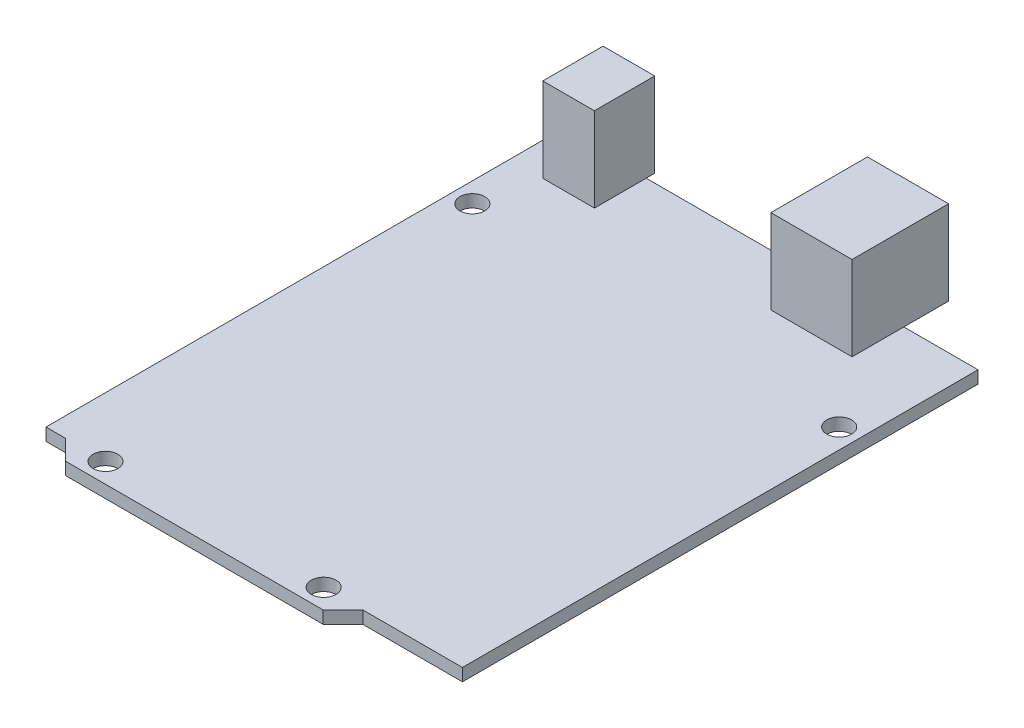
ISO-10303-21;
HEADER;
FILE_DESCRIPTION(('STEP AP214'),'2;1');
FILE_NAME('part.step','',(''),(''),'','','');
FILE_SCHEMA(('AUTOMOTIVE_DESIGN { 1 0 10303 214 1 1 1 1 }'));
ENDSEC;
DATA;
#1=APPLICATION_CONTEXT('core data for automotive mechanical design processes');
#2=APPLICATION_PROTOCOL_DEFINITION('international standard','automotive_design',2000,#1);
#3=PRODUCT_CONTEXT('',#1,'mechanical');
#4=PRODUCT('Part','Part','',(#3));
#5=PRODUCT_RELATED_PRODUCT_CATEGORY('part','',(#4));
#6=PRODUCT_DEFINITION_FORMATION('','',#4);
#7=PRODUCT_DEFINITION_CONTEXT('part definition',#1,'design');
#8=PRODUCT_DEFINITION('design','',#6,#7);
#9=PRODUCT_DEFINITION_SHAPE('','',#8);
#10=(LENGTH_UNIT() NAMED_UNIT(*) SI_UNIT(.MILLI.,.METRE.));
#11=(NAMED_UNIT(*) PLANE_ANGLE_UNIT() SI_UNIT($,.RADIAN.));
#12=(NAMED_UNIT(*) SI_UNIT($,.STERADIAN.) SOLID_ANGLE_UNIT());
#13=UNCERTAINTY_MEASURE_WITH_UNIT(LENGTH_MEASURE(1.E-05),#10,'distance_accuracy_value','');
#14=(GEOMETRIC_REPRESENTATION_CONTEXT(3) GLOBAL_UNCERTAINTY_ASSIGNED_CONTEXT((#13)) GLOBAL_UNIT_ASSIGNED_CONTEXT((#10,
#11,#12)) REPRESENTATION_CONTEXT('',''));
#15=CARTESIAN_POINT('',(0.,0.,0.));
#16=DIRECTION('',(0.,0.,1.));
#17=DIRECTION('',(1.,0.,0.));
#18=AXIS2_PLACEMENT_3D('',#15,#16,#17);
#19=CARTESIAN_POINT('',(53.34,1.6,-68.58));
#20=DIRECTION('',(0.,-1.,0.));
#21=DIRECTION('',(0.,0.,-1.));
#22=AXIS2_PLACEMENT_3D('',#19,#20,#21);
#23=PLANE('',#22);
#24=CARTESIAN_POINT('',(50.8,1.6,-53.34));
#25=DIRECTION('',(0.,1.,0.));
#26=DIRECTION('',(0.,0.,1.));
#27=AXIS2_PLACEMENT_3D('',#24,#25,#26);
#28=CIRCLE('',#27,1.5875);
#29=CARTESIAN_POINT('',(50.8,1.6,-51.7525));
#30=VERTEX_POINT('',#29);
#31=EDGE_CURVE('E571',#30,#30,#28,.T.);
#32=ORIENTED_EDGE('',*,*,#31,.F.);
#33=EDGE_LOOP('',(#32));
#34=FACE_BOUND('',#33,.T.);
#35=CARTESIAN_POINT('',(2.54,1.6,-54.61));
#36=DIRECTION('',(0.,1.,0.));
#37=DIRECTION('',(0.,0.,1.));
#38=AXIS2_PLACEMENT_3D('',#35,#36,#37);
#39=CIRCLE('',#38,1.5875);
#40=CARTESIAN_POINT('',(2.54,1.6,-53.0225));
#41=VERTEX_POINT('',#40);
#42=EDGE_CURVE('E573',#41,#41,#39,.T.);
#43=ORIENTED_EDGE('',*,*,#42,.F.);
#44=EDGE_LOOP('',(#43));
#45=FACE_BOUND('',#44,.T.);
#46=CARTESIAN_POINT('',(35.56,1.6,-2.54));
#47=DIRECTION('',(0.,1.,0.));
#48=DIRECTION('',(0.,0.,1.));
#49=AXIS2_PLACEMENT_3D('',#46,#47,#48);
#50=CIRCLE('',#49,1.5875);
#51=CARTESIAN_POINT('',(35.56,1.6,-0.952500000000002));
#52=VERTEX_POINT('',#51);
#53=EDGE_CURVE('E579',#52,#52,#50,.T.);
#54=ORIENTED_EDGE('',*,*,#53,.F.);
#55=EDGE_LOOP('',(#54));
#56=FACE_BOUND('',#55,.T.);
#57=CARTESIAN_POINT('',(7.62,1.6,-2.54));
#58=DIRECTION('',(0.,1.,0.));
#59=DIRECTION('',(0.,0.,1.));
#60=AXIS2_PLACEMENT_3D('',#57,#58,#59);
#61=CIRCLE('',#60,1.5875);
#62=CARTESIAN_POINT('',(7.62,1.6,-0.952499999999999));
#63=VERTEX_POINT('',#62);
#64=EDGE_CURVE('E585',#63,#63,#61,.T.);
#65=ORIENTED_EDGE('',*,*,#64,.F.);
#66=EDGE_LOOP('',(#65));
#67=FACE_BOUND('',#66,.T.);
#68=DIRECTION('',(0.,0.,1.));
#69=VECTOR('',#68,1.);
#70=CARTESIAN_POINT('',(33.4444138134349,1.6,-61.9470966350833));
#71=LINE('',#70,#69);
#72=CARTESIAN_POINT('',(33.4444138134349,1.6,-68.58));
#73=VERTEX_POINT('',#72);
#74=CARTESIAN_POINT('',(33.4444138134349,1.6,-61.9470966350833));
#75=VERTEX_POINT('',#74);
#76=EDGE_CURVE('E184',#73,#75,#71,.T.);
#77=ORIENTED_EDGE('',*,*,#76,.F.);
#78=DIRECTION('',(-1.,0.,0.));
#79=VECTOR('',#78,1.);
#80=CARTESIAN_POINT('',(0.,1.6,-68.58));
#81=LINE('',#80,#79);
#82=CARTESIAN_POINT('',(10.8409224668958,1.6,-68.58));
#83=VERTEX_POINT('',#82);
#84=EDGE_CURVE('E231',#73,#83,#81,.T.);
#85=ORIENTED_EDGE('',*,*,#84,.T.);
#86=DIRECTION('',(0.,0.,-1.));
#87=VECTOR('',#86,1.);
#88=CARTESIAN_POINT('',(10.8409224668958,1.6,-61.9470966350833));
#89=LINE('',#88,#87);
#90=CARTESIAN_POINT('',(10.8409224668958,1.6,-61.9470966350833));
#91=VERTEX_POINT('',#90);
#92=EDGE_CURVE('E206',#91,#83,#89,.T.);
#93=ORIENTED_EDGE('',*,*,#92,.F.);
#94=DIRECTION('',(1.,0.,0.));
#95=VECTOR('',#94,1.);
#96=CARTESIAN_POINT('',(4.22526646303065,1.6,-61.9470966350833));
#97=LINE('',#96,#95);
#98=CARTESIAN_POINT('',(4.22526646303065,1.6,-61.9470966350833));
#99=VERTEX_POINT('',#98);
#100=EDGE_CURVE('E187',#99,#91,#97,.T.);
#101=ORIENTED_EDGE('',*,*,#100,.F.);
#102=DIRECTION('',(0.,0.,1.));
#103=VECTOR('',#102,1.);
#104=CARTESIAN_POINT('',(4.22526646303065,1.6,-61.9470966350833));
#105=LINE('',#104,#103);
#106=CARTESIAN_POINT('',(4.22526646303065,1.6,-68.58));
#107=VERTEX_POINT('',#106);
#108=EDGE_CURVE('E11',#107,#99,#105,.T.);
#109=ORIENTED_EDGE('',*,*,#108,.F.);
#110=CARTESIAN_POINT('',(0.,1.6,-68.58));
#111=VERTEX_POINT('',#110);
#112=EDGE_CURVE('E225',#107,#111,#81,.T.);
#113=ORIENTED_EDGE('',*,*,#112,.T.);
#114=DIRECTION('',(0.,0.,1.));
#115=VECTOR('',#114,1.);
#116=CARTESIAN_POINT('',(0.,1.6,-68.58));
#117=LINE('',#116,#115);
#118=CARTESIAN_POINT('',(0.,1.6,-2.54));
#119=VERTEX_POINT('',#118);
#120=EDGE_CURVE('E229',#111,#119,#117,.T.);
#121=ORIENTED_EDGE('',*,*,#120,.T.);
#122=DIRECTION('',(1.,0.,0.));
#123=VECTOR('',#122,1.);
#124=CARTESIAN_POINT('',(0.,1.6,-2.54));
#125=LINE('',#124,#123);
#126=CARTESIAN_POINT('',(2.50000000000001,1.6,-2.54));
#127=VERTEX_POINT('',#126);
#128=EDGE_CURVE('E234',#119,#127,#125,.T.);
#129=ORIENTED_EDGE('',*,*,#128,.T.);
#130=DIRECTION('',(0.707106781186547,0.,0.707106781186549));
#131=VECTOR('',#130,1.);
#132=CARTESIAN_POINT('',(2.50000000000001,1.6,-2.54));
#133=LINE('',#132,#131);
#134=CARTESIAN_POINT('',(5.04,1.6,0.));
#135=VERTEX_POINT('',#134);
#136=EDGE_CURVE('E236',#127,#135,#133,.T.);
#137=ORIENTED_EDGE('',*,*,#136,.T.);
#138=DIRECTION('',(1.,0.,0.));
#139=VECTOR('',#138,1.);
#140=CARTESIAN_POINT('',(5.04,1.6,0.));
#141=LINE('',#140,#139);
#142=CARTESIAN_POINT('',(38.04,1.6,0.));
#143=VERTEX_POINT('',#142);
#144=EDGE_CURVE('E238',#135,#143,#141,.T.);
#145=ORIENTED_EDGE('',*,*,#144,.T.);
#146=DIRECTION('',(0.707106781186547,0.,-0.707106781186548));
#147=VECTOR('',#146,1.);
#148=CARTESIAN_POINT('',(38.04,1.6,0.));
#149=LINE('',#148,#147);
#150=CARTESIAN_POINT('',(40.58,1.6,-2.54));
#151=VERTEX_POINT('',#150);
#152=EDGE_CURVE('E240',#143,#151,#149,.T.);
#153=ORIENTED_EDGE('',*,*,#152,.T.);
#154=DIRECTION('',(1.,0.,0.));
#155=VECTOR('',#154,1.);
#156=CARTESIAN_POINT('',(40.58,1.6,-2.54));
#157=LINE('',#156,#155);
#158=CARTESIAN_POINT('',(53.34,1.6,-2.54));
#159=VERTEX_POINT('',#158);
#160=EDGE_CURVE('E242',#151,#159,#157,.T.);
#161=ORIENTED_EDGE('',*,*,#160,.T.);
#162=DIRECTION('',(0.,0.,-1.));
#163=VECTOR('',#162,1.);
#164=CARTESIAN_POINT('',(53.34,1.6,-2.54));
#165=LINE('',#164,#163);
#166=CARTESIAN_POINT('',(53.34,1.6,-68.58));
#167=VERTEX_POINT('',#166);
#168=EDGE_CURVE('E222',#159,#167,#165,.T.);
#169=ORIENTED_EDGE('',*,*,#168,.T.);
#170=CARTESIAN_POINT('',(43.8404446766516,1.6,-68.58));
#171=VERTEX_POINT('',#170);
#172=EDGE_CURVE('E227',#167,#171,#81,.T.);
#173=ORIENTED_EDGE('',*,*,#172,.T.);
#174=DIRECTION('',(0.,0.,-1.));
#175=VECTOR('',#174,1.);
#176=CARTESIAN_POINT('',(43.8404446766516,1.6,-61.9470966350833));
#177=LINE('',#176,#175);
#178=CARTESIAN_POINT('',(43.8404446766516,1.6,-61.9470966350833));
#179=VERTEX_POINT('',#178);
#180=EDGE_CURVE('E56',#179,#171,#177,.T.);
#181=ORIENTED_EDGE('',*,*,#180,.F.);
#182=DIRECTION('',(1.,0.,0.));
#183=VECTOR('',#182,1.);
#184=CARTESIAN_POINT('',(33.4444138134349,1.6,-61.9470966350833));
#185=LINE('',#184,#183);
#186=EDGE_CURVE('E51',#75,#179,#185,.T.);
#187=ORIENTED_EDGE('',*,*,#186,.F.);
#188=EDGE_LOOP('',(#77,#85,#93,#101,#109,#113,#121,#129,#137,#145,#153,#161,#169,#173,#181,#187));
#189=FACE_BOUND('',#188,.T.);
#190=ADVANCED_FACE('F34',(#34,#45,#56,#67,#189),#23,.F.);
#191=CARTESIAN_POINT('',(53.34,1.6,-2.54));
#192=DIRECTION('',(-1.,0.,0.));
#193=DIRECTION('',(0.,0.,1.));
#194=AXIS2_PLACEMENT_3D('',#191,#192,#193);
#195=PLANE('',#194);
#196=DIRECTION('',(0.,0.,-1.));
#197=VECTOR('',#196,1.);
#198=CARTESIAN_POINT('',(53.34,0.,-2.54));
#199=LINE('',#198,#197);
#200=CARTESIAN_POINT('',(53.34,0.,-2.54));
#201=VERTEX_POINT('',#200);
#202=CARTESIAN_POINT('',(53.34,0.,-68.58));
#203=VERTEX_POINT('',#202);
#204=EDGE_CURVE('E221',#201,#203,#199,.T.);
#205=ORIENTED_EDGE('',*,*,#204,.T.);
#206=DIRECTION('',(0.,-1.,0.));
#207=VECTOR('',#206,1.);
#208=CARTESIAN_POINT('',(53.34,1.6,-68.58));
#209=LINE('',#208,#207);
#210=EDGE_CURVE('E38',#167,#203,#209,.T.);
#211=ORIENTED_EDGE('',*,*,#210,.F.);
#212=ORIENTED_EDGE('',*,*,#168,.F.);
#213=DIRECTION('',(0.,-1.,0.));
#214=VECTOR('',#213,1.);
#215=CARTESIAN_POINT('',(53.34,1.6,-2.54));
#216=LINE('',#215,#214);
#217=EDGE_CURVE('E244',#159,#201,#216,.T.);
#218=ORIENTED_EDGE('',*,*,#217,.T.);
#219=EDGE_LOOP('',(#205,#211,#212,#218));
#220=FACE_BOUND('',#219,.T.);
#221=ADVANCED_FACE('F36',(#220),#195,.F.);
#222=CARTESIAN_POINT('',(0.,1.6,-68.58));
#223=DIRECTION('',(0.,0.,1.));
#224=DIRECTION('',(1.,0.,0.));
#225=AXIS2_PLACEMENT_3D('',#222,#223,#224);
#226=PLANE('',#225);
#227=DIRECTION('',(-1.,0.,0.));
#228=VECTOR('',#227,1.);
#229=CARTESIAN_POINT('',(0.,0.,-68.58));
#230=LINE('',#229,#228);
#231=CARTESIAN_POINT('',(0.,0.,-68.58));
#232=VERTEX_POINT('',#231);
#233=EDGE_CURVE('E247',#203,#232,#230,.T.);
#234=ORIENTED_EDGE('',*,*,#233,.T.);
#235=DIRECTION('',(0.,-1.,0.));
#236=VECTOR('',#235,1.);
#237=CARTESIAN_POINT('',(0.,1.6,-68.58));
#238=LINE('',#237,#236);
#239=EDGE_CURVE('E276',#111,#232,#238,.T.);
#240=ORIENTED_EDGE('',*,*,#239,.F.);
#241=ORIENTED_EDGE('',*,*,#112,.F.);
#242=EDGE_CURVE('E232',#83,#107,#81,.T.);
#243=ORIENTED_EDGE('',*,*,#242,.F.);
#244=ORIENTED_EDGE('',*,*,#84,.F.);
#245=EDGE_CURVE('E230',#171,#73,#81,.T.);
#246=ORIENTED_EDGE('',*,*,#245,.F.);
#247=ORIENTED_EDGE('',*,*,#172,.F.);
#248=ORIENTED_EDGE('',*,*,#210,.T.);
#249=EDGE_LOOP('',(#234,#240,#241,#243,#244,#246,#247,#248));
#250=FACE_BOUND('',#249,.T.);
#251=ADVANCED_FACE('F285',(#250),#226,.F.);
#252=CARTESIAN_POINT('',(0.,1.6,-68.58));
#253=DIRECTION('',(1.,0.,0.));
#254=DIRECTION('',(0.,0.,-1.));
#255=AXIS2_PLACEMENT_3D('',#252,#253,#254);
#256=PLANE('',#255);
#257=DIRECTION('',(0.,0.,1.));
#258=VECTOR('',#257,1.);
#259=CARTESIAN_POINT('',(0.,0.,-68.58));
#260=LINE('',#259,#258);
#261=CARTESIAN_POINT('',(0.,0.,-2.54));
#262=VERTEX_POINT('',#261);
#263=EDGE_CURVE('E249',#232,#262,#260,.T.);
#264=ORIENTED_EDGE('',*,*,#263,.T.);
#265=DIRECTION('',(0.,-1.,0.));
#266=VECTOR('',#265,1.);
#267=CARTESIAN_POINT('',(0.,1.6,-2.54));
#268=LINE('',#267,#266);
#269=EDGE_CURVE('E274',#119,#262,#268,.T.);
#270=ORIENTED_EDGE('',*,*,#269,.F.);
#271=ORIENTED_EDGE('',*,*,#120,.F.);
#272=ORIENTED_EDGE('',*,*,#239,.T.);
#273=EDGE_LOOP('',(#264,#270,#271,#272));
#274=FACE_BOUND('',#273,.T.);
#275=ADVANCED_FACE('F297',(#274),#256,.F.);
#276=CARTESIAN_POINT('',(0.,1.6,-2.54));
#277=DIRECTION('',(0.,0.,-1.));
#278=DIRECTION('',(-1.,0.,0.));
#279=AXIS2_PLACEMENT_3D('',#276,#277,#278);
#280=PLANE('',#279);
#281=DIRECTION('',(1.,0.,0.));
#282=VECTOR('',#281,1.);
#283=CARTESIAN_POINT('',(0.,0.,-2.54));
#284=LINE('',#283,#282);
#285=CARTESIAN_POINT('',(2.50000000000001,0.,-2.54));
#286=VERTEX_POINT('',#285);
#287=EDGE_CURVE('E251',#262,#286,#284,.T.);
#288=ORIENTED_EDGE('',*,*,#287,.T.);
#289=DIRECTION('',(0.,-1.,0.));
#290=VECTOR('',#289,1.);
#291=CARTESIAN_POINT('',(2.50000000000001,1.6,-2.54));
#292=LINE('',#291,#290);
#293=EDGE_CURVE('E271',#127,#286,#292,.T.);
#294=ORIENTED_EDGE('',*,*,#293,.F.);
#295=ORIENTED_EDGE('',*,*,#128,.F.);
#296=ORIENTED_EDGE('',*,*,#269,.T.);
#297=EDGE_LOOP('',(#288,#294,#295,#296));
#298=FACE_BOUND('',#297,.T.);
#299=ADVANCED_FACE('F300',(#298),#280,.F.);
#300=CARTESIAN_POINT('',(2.50000000000001,1.6,-2.54));
#301=DIRECTION('',(0.707106781186549,0.,-0.707106781186546));
#302=DIRECTION('',(-0.707106781186546,0.,-0.707106781186549));
#303=AXIS2_PLACEMENT_3D('',#300,#301,#302);
#304=PLANE('',#303);
#305=DIRECTION('',(0.707106781186547,0.,0.707106781186549));
#306=VECTOR('',#305,1.);
#307=CARTESIAN_POINT('',(2.50000000000001,0.,-2.54));
#308=LINE('',#307,#306);
#309=CARTESIAN_POINT('',(5.04,0.,0.));
#310=VERTEX_POINT('',#309);
#311=EDGE_CURVE('E253',#286,#310,#308,.T.);
#312=ORIENTED_EDGE('',*,*,#311,.T.);
#313=DIRECTION('',(0.,-1.,0.));
#314=VECTOR('',#313,1.);
#315=CARTESIAN_POINT('',(5.04,1.6,0.));
#316=LINE('',#315,#314);
#317=EDGE_CURVE('E268',#135,#310,#316,.T.);
#318=ORIENTED_EDGE('',*,*,#317,.F.);
#319=ORIENTED_EDGE('',*,*,#136,.F.);
#320=ORIENTED_EDGE('',*,*,#293,.T.);
#321=EDGE_LOOP('',(#312,#318,#319,#320));
#322=FACE_BOUND('',#321,.T.);
#323=ADVANCED_FACE('F368',(#322),#304,.F.);
#324=CARTESIAN_POINT('',(5.04,1.6,0.));
#325=DIRECTION('',(0.,0.,-1.));
#326=DIRECTION('',(-1.,0.,0.));
#327=AXIS2_PLACEMENT_3D('',#324,#325,#326);
#328=PLANE('',#327);
#329=DIRECTION('',(1.,0.,0.));
#330=VECTOR('',#329,1.);
#331=CARTESIAN_POINT('',(5.04,0.,0.));
#332=LINE('',#331,#330);
#333=CARTESIAN_POINT('',(38.04,0.,0.));
#334=VERTEX_POINT('',#333);
#335=EDGE_CURVE('E255',#310,#334,#332,.T.);
#336=ORIENTED_EDGE('',*,*,#335,.T.);
#337=DIRECTION('',(0.,-1.,0.));
#338=VECTOR('',#337,1.);
#339=CARTESIAN_POINT('',(38.04,1.6,0.));
#340=LINE('',#339,#338);
#341=EDGE_CURVE('E265',#143,#334,#340,.T.);
#342=ORIENTED_EDGE('',*,*,#341,.F.);
#343=ORIENTED_EDGE('',*,*,#144,.F.);
#344=ORIENTED_EDGE('',*,*,#317,.T.);
#345=EDGE_LOOP('',(#336,#342,#343,#344));
#346=FACE_BOUND('',#345,.T.);
#347=ADVANCED_FACE('F364',(#346),#328,.F.);
#348=CARTESIAN_POINT('',(38.04,1.6,0.));
#349=DIRECTION('',(-0.707106781186548,0.,-0.707106781186547));
#350=DIRECTION('',(-0.707106781186547,0.,0.707106781186548));
#351=AXIS2_PLACEMENT_3D('',#348,#349,#350);
#352=PLANE('',#351);
#353=DIRECTION('',(0.707106781186547,0.,-0.707106781186548));
#354=VECTOR('',#353,1.);
#355=CARTESIAN_POINT('',(38.04,0.,0.));
#356=LINE('',#355,#354);
#357=CARTESIAN_POINT('',(40.58,0.,-2.54));
#358=VERTEX_POINT('',#357);
#359=EDGE_CURVE('E257',#334,#358,#356,.T.);
#360=ORIENTED_EDGE('',*,*,#359,.T.);
#361=DIRECTION('',(0.,-1.,0.));
#362=VECTOR('',#361,1.);
#363=CARTESIAN_POINT('',(40.58,1.6,-2.54));
#364=LINE('',#363,#362);
#365=EDGE_CURVE('E262',#151,#358,#364,.T.);
#366=ORIENTED_EDGE('',*,*,#365,.F.);
#367=ORIENTED_EDGE('',*,*,#152,.F.);
#368=ORIENTED_EDGE('',*,*,#341,.T.);
#369=EDGE_LOOP('',(#360,#366,#367,#368));
#370=FACE_BOUND('',#369,.T.);
#371=ADVANCED_FACE('F360',(#370),#352,.F.);
#372=CARTESIAN_POINT('',(40.58,1.6,-2.54));
#373=DIRECTION('',(0.,0.,-1.));
#374=DIRECTION('',(-1.,0.,0.));
#375=AXIS2_PLACEMENT_3D('',#372,#373,#374);
#376=PLANE('',#375);
#377=DIRECTION('',(1.,0.,0.));
#378=VECTOR('',#377,1.);
#379=CARTESIAN_POINT('',(40.58,0.,-2.54));
#380=LINE('',#379,#378);
#381=EDGE_CURVE('E226',#358,#201,#380,.T.);
#382=ORIENTED_EDGE('',*,*,#381,.T.);
#383=ORIENTED_EDGE('',*,*,#217,.F.);
#384=ORIENTED_EDGE('',*,*,#160,.F.);
#385=ORIENTED_EDGE('',*,*,#365,.T.);
#386=EDGE_LOOP('',(#382,#383,#384,#385));
#387=FACE_BOUND('',#386,.T.);
#388=ADVANCED_FACE('F356',(#387),#376,.F.);
#389=CARTESIAN_POINT('',(53.34,0.,-68.58));
#390=DIRECTION('',(0.,-1.,0.));
#391=DIRECTION('',(0.,0.,-1.));
#392=AXIS2_PLACEMENT_3D('',#389,#390,#391);
#393=PLANE('',#392);
#394=CARTESIAN_POINT('',(50.8,0.,-53.34));
#395=DIRECTION('',(0.,1.,0.));
#396=DIRECTION('',(0.,0.,1.));
#397=AXIS2_PLACEMENT_3D('',#394,#395,#396);
#398=CIRCLE('',#397,1.5875);
#399=CARTESIAN_POINT('',(50.8,0.,-51.7525));
#400=VERTEX_POINT('',#399);
#401=EDGE_CURVE('E569',#400,#400,#398,.T.);
#402=ORIENTED_EDGE('',*,*,#401,.T.);
#403=EDGE_LOOP('',(#402));
#404=FACE_BOUND('',#403,.T.);
#405=CARTESIAN_POINT('',(2.54,0.,-54.61));
#406=DIRECTION('',(0.,1.,0.));
#407=DIRECTION('',(0.,0.,1.));
#408=AXIS2_PLACEMENT_3D('',#405,#406,#407);
#409=CIRCLE('',#408,1.5875);
#410=CARTESIAN_POINT('',(2.54,0.,-53.0225));
#411=VERTEX_POINT('',#410);
#412=EDGE_CURVE('E576',#411,#411,#409,.T.);
#413=ORIENTED_EDGE('',*,*,#412,.T.);
#414=EDGE_LOOP('',(#413));
#415=FACE_BOUND('',#414,.T.);
#416=CARTESIAN_POINT('',(35.56,0.,-2.54));
#417=DIRECTION('',(0.,1.,0.));
#418=DIRECTION('',(0.,0.,1.));
#419=AXIS2_PLACEMENT_3D('',#416,#417,#418);
#420=CIRCLE('',#419,1.5875);
#421=CARTESIAN_POINT('',(35.56,0.,-0.952500000000002));
#422=VERTEX_POINT('',#421);
#423=EDGE_CURVE('E582',#422,#422,#420,.T.);
#424=ORIENTED_EDGE('',*,*,#423,.T.);
#425=EDGE_LOOP('',(#424));
#426=FACE_BOUND('',#425,.T.);
#427=CARTESIAN_POINT('',(7.62,0.,-2.54));
#428=DIRECTION('',(0.,1.,0.));
#429=DIRECTION('',(0.,0.,1.));
#430=AXIS2_PLACEMENT_3D('',#427,#428,#429);
#431=CIRCLE('',#430,1.5875);
#432=CARTESIAN_POINT('',(7.62,0.,-0.952499999999999));
#433=VERTEX_POINT('',#432);
#434=EDGE_CURVE('E588',#433,#433,#431,.T.);
#435=ORIENTED_EDGE('',*,*,#434,.T.);
#436=EDGE_LOOP('',(#435));
#437=FACE_BOUND('',#436,.T.);
#438=ORIENTED_EDGE('',*,*,#204,.F.);
#439=ORIENTED_EDGE('',*,*,#381,.F.);
#440=ORIENTED_EDGE('',*,*,#359,.F.);
#441=ORIENTED_EDGE('',*,*,#335,.F.);
#442=ORIENTED_EDGE('',*,*,#311,.F.);
#443=ORIENTED_EDGE('',*,*,#287,.F.);
#444=ORIENTED_EDGE('',*,*,#263,.F.);
#445=ORIENTED_EDGE('',*,*,#233,.F.);
#446=EDGE_LOOP('',(#438,#439,#440,#441,#442,#443,#444,#445));
#447=FACE_BOUND('',#446,.T.);
#448=ADVANCED_FACE('F292',(#404,#415,#426,#437,#447),#393,.T.);
#449=CARTESIAN_POINT('',(4.22526646303065,12.4,-61.9470966350833));
#450=DIRECTION('',(1.,0.,0.));
#451=DIRECTION('',(0.,0.,-1.));
#452=AXIS2_PLACEMENT_3D('',#449,#450,#451);
#453=PLANE('',#452);
#454=CARTESIAN_POINT('',(4.22526646303065,1.6,-69.665361972926));
#455=VERTEX_POINT('',#454);
#456=EDGE_CURVE('E44',#455,#107,#105,.T.);
#457=ORIENTED_EDGE('',*,*,#456,.T.);
#458=ORIENTED_EDGE('',*,*,#108,.T.);
#459=DIRECTION('',(0.,-1.,0.));
#460=VECTOR('',#459,1.);
#461=CARTESIAN_POINT('',(4.22526646303065,12.4,-61.9470966350833));
#462=LINE('',#461,#460);
#463=CARTESIAN_POINT('',(4.22526646303065,12.4,-61.9470966350833));
#464=VERTEX_POINT('',#463);
#465=EDGE_CURVE('E218',#464,#99,#462,.T.);
#466=ORIENTED_EDGE('',*,*,#465,.F.);
#467=DIRECTION('',(0.,0.,1.));
#468=VECTOR('',#467,1.);
#469=CARTESIAN_POINT('',(4.22526646303065,12.4,-61.9470966350833));
#470=LINE('',#469,#468);
#471=CARTESIAN_POINT('',(4.22526646303065,12.4,-69.665361972926));
#472=VERTEX_POINT('',#471);
#473=EDGE_CURVE('E192',#472,#464,#470,.T.);
#474=ORIENTED_EDGE('',*,*,#473,.F.);
#475=DIRECTION('',(0.,-1.,0.));
#476=VECTOR('',#475,1.);
#477=CARTESIAN_POINT('',(4.22526646303065,12.4,-69.665361972926));
#478=LINE('',#477,#476);
#479=EDGE_CURVE('E201',#472,#455,#478,.T.);
#480=ORIENTED_EDGE('',*,*,#479,.T.);
#481=EDGE_LOOP('',(#457,#458,#466,#474,#480));
#482=FACE_BOUND('',#481,.T.);
#483=ADVANCED_FACE('F325',(#482),#453,.F.);
#484=CARTESIAN_POINT('',(4.22526646303065,12.4,-61.9470966350833));
#485=DIRECTION('',(0.,0.,-1.));
#486=DIRECTION('',(-1.,0.,0.));
#487=AXIS2_PLACEMENT_3D('',#484,#485,#486);
#488=PLANE('',#487);
#489=ORIENTED_EDGE('',*,*,#100,.T.);
#490=DIRECTION('',(0.,-1.,0.));
#491=VECTOR('',#490,1.);
#492=CARTESIAN_POINT('',(10.8409224668958,12.4,-61.9470966350833));
#493=LINE('',#492,#491);
#494=CARTESIAN_POINT('',(10.8409224668958,12.4,-61.9470966350833));
#495=VERTEX_POINT('',#494);
#496=EDGE_CURVE('E215',#495,#91,#493,.T.);
#497=ORIENTED_EDGE('',*,*,#496,.F.);
#498=DIRECTION('',(1.,0.,0.));
#499=VECTOR('',#498,1.);
#500=CARTESIAN_POINT('',(4.22526646303065,12.4,-61.9470966350833));
#501=LINE('',#500,#499);
#502=EDGE_CURVE('E195',#464,#495,#501,.T.);
#503=ORIENTED_EDGE('',*,*,#502,.F.);
#504=ORIENTED_EDGE('',*,*,#465,.T.);
#505=EDGE_LOOP('',(#489,#497,#503,#504));
#506=FACE_BOUND('',#505,.T.);
#507=ADVANCED_FACE('F322',(#506),#488,.F.);
#508=CARTESIAN_POINT('',(10.8409224668958,12.4,-61.9470966350833));
#509=DIRECTION('',(-1.,0.,0.));
#510=DIRECTION('',(0.,0.,1.));
#511=AXIS2_PLACEMENT_3D('',#508,#509,#510);
#512=PLANE('',#511);
#513=ORIENTED_EDGE('',*,*,#92,.T.);
#514=CARTESIAN_POINT('',(10.8409224668958,1.6,-69.665361972926));
#515=VERTEX_POINT('',#514);
#516=EDGE_CURVE('E205',#83,#515,#89,.T.);
#517=ORIENTED_EDGE('',*,*,#516,.T.);
#518=DIRECTION('',(0.,-1.,0.));
#519=VECTOR('',#518,1.);
#520=CARTESIAN_POINT('',(10.8409224668958,12.4,-69.665361972926));
#521=LINE('',#520,#519);
#522=CARTESIAN_POINT('',(10.8409224668958,12.4,-69.665361972926));
#523=VERTEX_POINT('',#522);
#524=EDGE_CURVE('E212',#523,#515,#521,.T.);
#525=ORIENTED_EDGE('',*,*,#524,.F.);
#526=DIRECTION('',(0.,0.,-1.));
#527=VECTOR('',#526,1.);
#528=CARTESIAN_POINT('',(10.8409224668958,12.4,-61.9470966350833));
#529=LINE('',#528,#527);
#530=EDGE_CURVE('E198',#495,#523,#529,.T.);
#531=ORIENTED_EDGE('',*,*,#530,.F.);
#532=ORIENTED_EDGE('',*,*,#496,.T.);
#533=EDGE_LOOP('',(#513,#517,#525,#531,#532));
#534=FACE_BOUND('',#533,.T.);
#535=ADVANCED_FACE('F318',(#534),#512,.F.);
#536=CARTESIAN_POINT('',(4.22526646303065,12.4,-69.665361972926));
#537=DIRECTION('',(0.,0.,1.));
#538=DIRECTION('',(1.,0.,0.));
#539=AXIS2_PLACEMENT_3D('',#536,#537,#538);
#540=PLANE('',#539);
#541=DIRECTION('',(-1.,0.,0.));
#542=VECTOR('',#541,1.);
#543=CARTESIAN_POINT('',(4.22526646303065,1.6,-69.665361972926));
#544=LINE('',#543,#542);
#545=EDGE_CURVE('E196',#515,#455,#544,.T.);
#546=ORIENTED_EDGE('',*,*,#545,.T.);
#547=ORIENTED_EDGE('',*,*,#479,.F.);
#548=DIRECTION('',(-1.,0.,0.));
#549=VECTOR('',#548,1.);
#550=CARTESIAN_POINT('',(4.22526646303065,12.4,-69.665361972926));
#551=LINE('',#550,#549);
#552=EDGE_CURVE('E200',#523,#472,#551,.T.);
#553=ORIENTED_EDGE('',*,*,#552,.F.);
#554=ORIENTED_EDGE('',*,*,#524,.T.);
#555=EDGE_LOOP('',(#546,#547,#553,#554));
#556=FACE_BOUND('',#555,.T.);
#557=ADVANCED_FACE('F330',(#556),#540,.F.);
#558=CARTESIAN_POINT('',(4.22526646303065,12.4,-69.665361972926));
#559=DIRECTION('',(0.,-1.,0.));
#560=DIRECTION('',(0.,0.,-1.));
#561=AXIS2_PLACEMENT_3D('',#558,#559,#560);
#562=PLANE('',#561);
#563=ORIENTED_EDGE('',*,*,#473,.T.);
#564=ORIENTED_EDGE('',*,*,#502,.T.);
#565=ORIENTED_EDGE('',*,*,#530,.T.);
#566=ORIENTED_EDGE('',*,*,#552,.T.);
#567=EDGE_LOOP('',(#563,#564,#565,#566));
#568=FACE_BOUND('',#567,.T.);
#569=ADVANCED_FACE('F332',(#568),#562,.F.);
#570=CARTESIAN_POINT('',(4.22526646303065,1.6,-69.665361972926));
#571=DIRECTION('',(0.,-1.,0.));
#572=DIRECTION('',(0.,0.,-1.));
#573=AXIS2_PLACEMENT_3D('',#570,#571,#572);
#574=PLANE('',#573);
#575=ORIENTED_EDGE('',*,*,#516,.F.);
#576=ORIENTED_EDGE('',*,*,#242,.T.);
#577=ORIENTED_EDGE('',*,*,#456,.F.);
#578=ORIENTED_EDGE('',*,*,#545,.F.);
#579=EDGE_LOOP('',(#575,#576,#577,#578));
#580=FACE_BOUND('',#579,.T.);
#581=ADVANCED_FACE('F315',(#580),#574,.T.);
#582=CARTESIAN_POINT('',(33.4444138134349,1.6,-74.3120727375455));
#583=DIRECTION('',(0.,-1.,0.));
#584=DIRECTION('',(0.,0.,-1.));
#585=AXIS2_PLACEMENT_3D('',#582,#583,#584);
#586=PLANE('',#585);
#587=ORIENTED_EDGE('',*,*,#245,.T.);
#588=CARTESIAN_POINT('',(33.4444138134349,1.6,-74.3120727375455));
#589=VERTEX_POINT('',#588);
#590=EDGE_CURVE('E596',#589,#73,#71,.T.);
#591=ORIENTED_EDGE('',*,*,#590,.F.);
#592=DIRECTION('',(-1.,0.,0.));
#593=VECTOR('',#592,1.);
#594=CARTESIAN_POINT('',(33.4444138134349,1.6,-74.3120727375455));
#595=LINE('',#594,#593);
#596=CARTESIAN_POINT('',(43.8404446766516,1.6,-74.3120727375455));
#597=VERTEX_POINT('',#596);
#598=EDGE_CURVE('E180',#597,#589,#595,.T.);
#599=ORIENTED_EDGE('',*,*,#598,.F.);
#600=EDGE_CURVE('E599',#171,#597,#177,.T.);
#601=ORIENTED_EDGE('',*,*,#600,.F.);
#602=EDGE_LOOP('',(#587,#591,#599,#601));
#603=FACE_BOUND('',#602,.T.);
#604=ADVANCED_FACE('F339',(#603),#586,.T.);
#605=CARTESIAN_POINT('',(33.4444138134349,12.4,-61.9470966350833));
#606=DIRECTION('',(1.,0.,0.));
#607=DIRECTION('',(0.,0.,-1.));
#608=AXIS2_PLACEMENT_3D('',#605,#606,#607);
#609=PLANE('',#608);
#610=ORIENTED_EDGE('',*,*,#590,.T.);
#611=ORIENTED_EDGE('',*,*,#76,.T.);
#612=DIRECTION('',(0.,-1.,0.));
#613=VECTOR('',#612,1.);
#614=CARTESIAN_POINT('',(33.4444138134349,12.4,-61.9470966350833));
#615=LINE('',#614,#613);
#616=CARTESIAN_POINT('',(33.4444138134349,12.4,-61.9470966350833));
#617=VERTEX_POINT('',#616);
#618=EDGE_CURVE('E165',#617,#75,#615,.T.);
#619=ORIENTED_EDGE('',*,*,#618,.F.);
#620=DIRECTION('',(0.,0.,1.));
#621=VECTOR('',#620,1.);
#622=CARTESIAN_POINT('',(33.4444138134349,12.4,-61.9470966350833));
#623=LINE('',#622,#621);
#624=CARTESIAN_POINT('',(33.4444138134349,12.4,-74.3120727375455));
#625=VERTEX_POINT('',#624);
#626=EDGE_CURVE('E171',#625,#617,#623,.T.);
#627=ORIENTED_EDGE('',*,*,#626,.F.);
#628=DIRECTION('',(0.,-1.,0.));
#629=VECTOR('',#628,1.);
#630=CARTESIAN_POINT('',(33.4444138134349,12.4,-74.3120727375455));
#631=LINE('',#630,#629);
#632=EDGE_CURVE('E595',#625,#589,#631,.T.);
#633=ORIENTED_EDGE('',*,*,#632,.T.);
#634=EDGE_LOOP('',(#610,#611,#619,#627,#633));
#635=FACE_BOUND('',#634,.T.);
#636=ADVANCED_FACE('F183',(#635),#609,.F.);
#637=CARTESIAN_POINT('',(33.4444138134349,12.4,-61.9470966350833));
#638=DIRECTION('',(0.,0.,-1.));
#639=DIRECTION('',(-1.,0.,0.));
#640=AXIS2_PLACEMENT_3D('',#637,#638,#639);
#641=PLANE('',#640);
#642=ORIENTED_EDGE('',*,*,#186,.T.);
#643=DIRECTION('',(0.,-1.,0.));
#644=VECTOR('',#643,1.);
#645=CARTESIAN_POINT('',(43.8404446766516,12.4,-61.9470966350833));
#646=LINE('',#645,#644);
#647=CARTESIAN_POINT('',(43.8404446766516,12.4,-61.9470966350833));
#648=VERTEX_POINT('',#647);
#649=EDGE_CURVE('E167',#648,#179,#646,.T.);
#650=ORIENTED_EDGE('',*,*,#649,.F.);
#651=DIRECTION('',(1.,0.,0.));
#652=VECTOR('',#651,1.);
#653=CARTESIAN_POINT('',(33.4444138134349,12.4,-61.9470966350833));
#654=LINE('',#653,#652);
#655=EDGE_CURVE('E161',#617,#648,#654,.T.);
#656=ORIENTED_EDGE('',*,*,#655,.F.);
#657=ORIENTED_EDGE('',*,*,#618,.T.);
#658=EDGE_LOOP('',(#642,#650,#656,#657));
#659=FACE_BOUND('',#658,.T.);
#660=ADVANCED_FACE('F163',(#659),#641,.F.);
#661=CARTESIAN_POINT('',(43.8404446766516,12.4,-61.9470966350833));
#662=DIRECTION('',(-1.,0.,0.));
#663=DIRECTION('',(0.,0.,1.));
#664=AXIS2_PLACEMENT_3D('',#661,#662,#663);
#665=PLANE('',#664);
#666=ORIENTED_EDGE('',*,*,#180,.T.);
#667=ORIENTED_EDGE('',*,*,#600,.T.);
#668=DIRECTION('',(0.,-1.,0.));
#669=VECTOR('',#668,1.);
#670=CARTESIAN_POINT('',(43.8404446766516,12.4,-74.3120727375455));
#671=LINE('',#670,#669);
#672=CARTESIAN_POINT('',(43.8404446766516,12.4,-74.3120727375455));
#673=VERTEX_POINT('',#672);
#674=EDGE_CURVE('E188',#673,#597,#671,.T.);
#675=ORIENTED_EDGE('',*,*,#674,.F.);
#676=DIRECTION('',(0.,0.,-1.));
#677=VECTOR('',#676,1.);
#678=CARTESIAN_POINT('',(43.8404446766516,12.4,-61.9470966350833));
#679=LINE('',#678,#677);
#680=EDGE_CURVE('E170',#648,#673,#679,.T.);
#681=ORIENTED_EDGE('',*,*,#680,.F.);
#682=ORIENTED_EDGE('',*,*,#649,.T.);
#683=EDGE_LOOP('',(#666,#667,#675,#681,#682));
#684=FACE_BOUND('',#683,.T.);
#685=ADVANCED_FACE('F465',(#684),#665,.F.);
#686=CARTESIAN_POINT('',(33.4444138134349,12.4,-74.3120727375455));
#687=DIRECTION('',(0.,0.,1.));
#688=DIRECTION('',(1.,0.,0.));
#689=AXIS2_PLACEMENT_3D('',#686,#687,#688);
#690=PLANE('',#689);
#691=ORIENTED_EDGE('',*,*,#598,.T.);
#692=ORIENTED_EDGE('',*,*,#632,.F.);
#693=DIRECTION('',(-1.,0.,0.));
#694=VECTOR('',#693,1.);
#695=CARTESIAN_POINT('',(33.4444138134349,12.4,-74.3120727375455));
#696=LINE('',#695,#694);
#697=EDGE_CURVE('E176',#673,#625,#696,.T.);
#698=ORIENTED_EDGE('',*,*,#697,.F.);
#699=ORIENTED_EDGE('',*,*,#674,.T.);
#700=EDGE_LOOP('',(#691,#692,#698,#699));
#701=FACE_BOUND('',#700,.T.);
#702=ADVANCED_FACE('F474',(#701),#690,.F.);
#703=CARTESIAN_POINT('',(33.4444138134349,12.4,-74.3120727375455));
#704=DIRECTION('',(0.,-1.,0.));
#705=DIRECTION('',(0.,0.,-1.));
#706=AXIS2_PLACEMENT_3D('',#703,#704,#705);
#707=PLANE('',#706);
#708=ORIENTED_EDGE('',*,*,#626,.T.);
#709=ORIENTED_EDGE('',*,*,#655,.T.);
#710=ORIENTED_EDGE('',*,*,#680,.T.);
#711=ORIENTED_EDGE('',*,*,#697,.T.);
#712=EDGE_LOOP('',(#708,#709,#710,#711));
#713=FACE_BOUND('',#712,.T.);
#714=ADVANCED_FACE('F174',(#713),#707,.F.);
#715=CARTESIAN_POINT('',(7.62,0.,-2.54));
#716=DIRECTION('',(0.,1.,0.));
#717=DIRECTION('',(0.,0.,1.));
#718=AXIS2_PLACEMENT_3D('',#715,#716,#717);
#719=CYLINDRICAL_SURFACE('',#718,1.5875);
#720=ORIENTED_EDGE('',*,*,#434,.F.);
#721=EDGE_LOOP('',(#720));
#722=FACE_BOUND('',#721,.T.);
#723=ORIENTED_EDGE('',*,*,#64,.T.);
#724=EDGE_LOOP('',(#723));
#725=FACE_BOUND('',#724,.T.);
#726=ADVANCED_FACE('F492',(#722,#725),#719,.F.);
#727=CARTESIAN_POINT('',(35.56,0.,-2.54));
#728=DIRECTION('',(0.,1.,0.));
#729=DIRECTION('',(0.,0.,1.));
#730=AXIS2_PLACEMENT_3D('',#727,#728,#729);
#731=CYLINDRICAL_SURFACE('',#730,1.5875);
#732=ORIENTED_EDGE('',*,*,#423,.F.);
#733=EDGE_LOOP('',(#732));
#734=FACE_BOUND('',#733,.T.);
#735=ORIENTED_EDGE('',*,*,#53,.T.);
#736=EDGE_LOOP('',(#735));
#737=FACE_BOUND('',#736,.T.);
#738=ADVANCED_FACE('F532',(#734,#737),#731,.F.);
#739=CARTESIAN_POINT('',(2.54,0.,-54.61));
#740=DIRECTION('',(0.,1.,0.));
#741=DIRECTION('',(0.,0.,1.));
#742=AXIS2_PLACEMENT_3D('',#739,#740,#741);
#743=CYLINDRICAL_SURFACE('',#742,1.5875);
#744=ORIENTED_EDGE('',*,*,#412,.F.);
#745=EDGE_LOOP('',(#744));
#746=FACE_BOUND('',#745,.T.);
#747=ORIENTED_EDGE('',*,*,#42,.T.);
#748=EDGE_LOOP('',(#747));
#749=FACE_BOUND('',#748,.T.);
#750=ADVANCED_FACE('F539',(#746,#749),#743,.F.);
#751=CARTESIAN_POINT('',(50.8,0.,-53.34));
#752=DIRECTION('',(0.,1.,0.));
#753=DIRECTION('',(0.,0.,1.));
#754=AXIS2_PLACEMENT_3D('',#751,#752,#753);
#755=CYLINDRICAL_SURFACE('',#754,1.5875);
#756=ORIENTED_EDGE('',*,*,#401,.F.);
#757=EDGE_LOOP('',(#756));
#758=FACE_BOUND('',#757,.T.);
#759=ORIENTED_EDGE('',*,*,#31,.T.);
#760=EDGE_LOOP('',(#759));
#761=FACE_BOUND('',#760,.T.);
#762=ADVANCED_FACE('F547',(#758,#761),#755,.F.);
#763=CLOSED_SHELL('',(#190,#221,#251,#275,#299,#323,#347,#371,#388,#448,#483,#507,#535,#557,
#569,#581,#604,#636,#660,#685,#702,#714,#726,#738,#750,#762));
#764=MANIFOLD_SOLID_BREP('B2',#763);
#765=ADVANCED_BREP_SHAPE_REPRESENTATION('',(#18,#764),#14);
#766=SHAPE_DEFINITION_REPRESENTATION(#9,#765);
ENDSEC;
END-ISO-10303-21;
